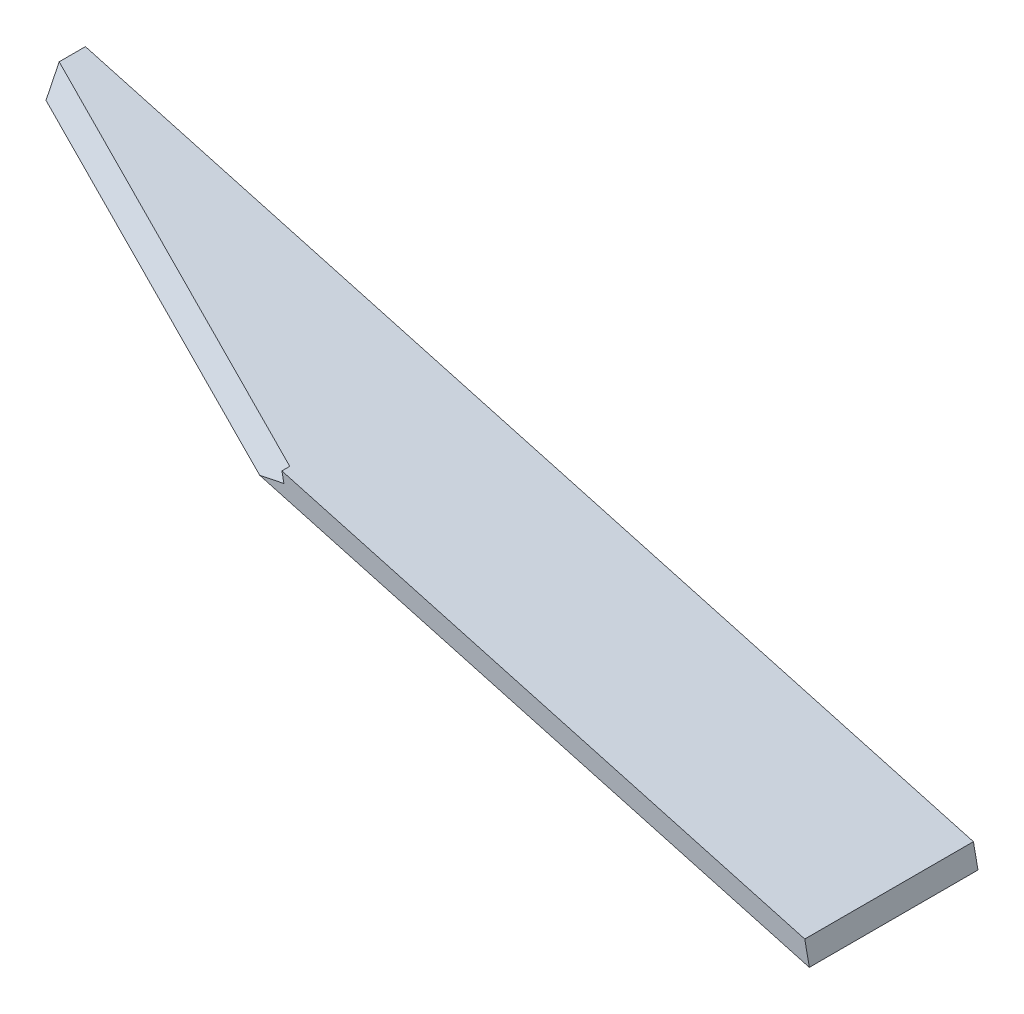
ISO-10303-21;
HEADER;
FILE_DESCRIPTION(('STEP AP214'),'2;1');
FILE_NAME('part.step','',(''),(''),'','','');
FILE_SCHEMA(('AUTOMOTIVE_DESIGN { 1 0 10303 214 1 1 1 1 }'));
ENDSEC;
DATA;
#1=APPLICATION_CONTEXT('core data for automotive mechanical design processes');
#2=APPLICATION_PROTOCOL_DEFINITION('international standard','automotive_design',2000,#1);
#3=PRODUCT_CONTEXT('',#1,'mechanical');
#4=PRODUCT('Part','Part','',(#3));
#5=PRODUCT_RELATED_PRODUCT_CATEGORY('part','',(#4));
#6=PRODUCT_DEFINITION_FORMATION('','',#4);
#7=PRODUCT_DEFINITION_CONTEXT('part definition',#1,'design');
#8=PRODUCT_DEFINITION('design','',#6,#7);
#9=PRODUCT_DEFINITION_SHAPE('','',#8);
#10=(LENGTH_UNIT() NAMED_UNIT(*) SI_UNIT(.MILLI.,.METRE.));
#11=(NAMED_UNIT(*) PLANE_ANGLE_UNIT() SI_UNIT($,.RADIAN.));
#12=(NAMED_UNIT(*) SI_UNIT($,.STERADIAN.) SOLID_ANGLE_UNIT());
#13=UNCERTAINTY_MEASURE_WITH_UNIT(LENGTH_MEASURE(1.E-05),#10,'distance_accuracy_value','');
#14=(GEOMETRIC_REPRESENTATION_CONTEXT(3) GLOBAL_UNCERTAINTY_ASSIGNED_CONTEXT((#13)) GLOBAL_UNIT_ASSIGNED_CONTEXT((#10,
#11,#12)) REPRESENTATION_CONTEXT('',''));
#15=CARTESIAN_POINT('',(0.,0.,0.));
#16=DIRECTION('',(0.,0.,1.));
#17=DIRECTION('',(1.,0.,0.));
#18=AXIS2_PLACEMENT_3D('',#15,#16,#17);
#19=CARTESIAN_POINT('',(-77.3810927083152,19.1832023042959,25.));
#20=DIRECTION('',(-0.265473079740289,-0.964118272792921,0.));
#21=DIRECTION('',(0.964118272792922,-0.265473079740289,0.));
#22=AXIS2_PLACEMENT_3D('',#19,#20,#21);
#23=PLANE('',#22);
#24=DIRECTION('',(0.,0.,-1.));
#25=VECTOR('',#24,1.);
#26=CARTESIAN_POINT('',(-154.885449628019,40.5242772588866,25.));
#27=LINE('',#26,#25);
#28=CARTESIAN_POINT('',(-154.885449628019,40.5242772588866,25.));
#29=VERTEX_POINT('',#28);
#30=CARTESIAN_POINT('',(-154.885449628019,40.5242772588866,23.8308301144486));
#31=VERTEX_POINT('',#30);
#32=EDGE_CURVE('E101',#29,#31,#27,.T.);
#33=ORIENTED_EDGE('',*,*,#32,.F.);
#34=DIRECTION('',(-0.964118272792921,0.265473079740289,0.));
#35=VECTOR('',#34,1.);
#36=CARTESIAN_POINT('',(-77.3810927083152,19.1832023042959,25.));
#37=LINE('',#36,#35);
#38=CARTESIAN_POINT('',(-77.3810927083152,19.1832023042959,25.));
#39=VERTEX_POINT('',#38);
#40=EDGE_CURVE('E86',#39,#29,#37,.T.);
#41=ORIENTED_EDGE('',*,*,#40,.F.);
#42=DIRECTION('',(0.,0.,-1.));
#43=VECTOR('',#42,1.);
#44=CARTESIAN_POINT('',(-77.3810927083152,19.1832023042959,25.));
#45=LINE('',#44,#43);
#46=CARTESIAN_POINT('',(-77.3810927083152,19.1832023042959,0.));
#47=VERTEX_POINT('',#46);
#48=EDGE_CURVE('E112',#39,#47,#45,.T.);
#49=ORIENTED_EDGE('',*,*,#48,.T.);
#50=DIRECTION('',(-0.964118272792921,0.265473079740289,0.));
#51=VECTOR('',#50,1.);
#52=CARTESIAN_POINT('',(-77.3810927083152,19.1832023042959,0.));
#53=LINE('',#52,#51);
#54=CARTESIAN_POINT('',(-209.008603900881,55.4272625621863,0.));
#55=VERTEX_POINT('',#54);
#56=EDGE_CURVE('E96',#47,#55,#53,.T.);
#57=ORIENTED_EDGE('',*,*,#56,.T.);
#58=DIRECTION('',(0.,0.,-1.));
#59=VECTOR('',#58,1.);
#60=CARTESIAN_POINT('',(-209.008603900881,55.4272625621863,25.));
#61=LINE('',#60,#59);
#62=CARTESIAN_POINT('',(-209.00860390124,55.4272625621122,3.89021068016565));
#63=VERTEX_POINT('',#62);
#64=EDGE_CURVE('E85',#63,#55,#61,.T.);
#65=ORIENTED_EDGE('',*,*,#64,.F.);
#66=DIRECTION('',(0.908505293732806,-0.250159866370883,0.334721036860205));
#67=VECTOR('',#66,1.);
#68=CARTESIAN_POINT('',(-85.7089995283556,21.4763183396365,49.3175424796902));
#69=LINE('',#68,#67);
#70=EDGE_CURVE('E105',#63,#31,#69,.T.);
#71=ORIENTED_EDGE('',*,*,#70,.T.);
#72=EDGE_LOOP('',(#33,#41,#49,#57,#65,#71));
#73=FACE_BOUND('',#72,.T.);
#74=ADVANCED_FACE('F33',(#73),#23,.F.);
#75=CARTESIAN_POINT('',(0.,0.,25.));
#76=DIRECTION('',(0.,0.,-1.));
#77=DIRECTION('',(-1.,0.,0.));
#78=AXIS2_PLACEMENT_3D('',#75,#76,#77);
#79=PLANE('',#78);
#80=DIRECTION('',(-0.201886068959674,0.979409013211544,0.));
#81=VECTOR('',#80,1.);
#82=CARTESIAN_POINT('',(-140.55980456013,-28.973662702301,25.));
#83=LINE('',#82,#81);
#84=CARTESIAN_POINT('',(-154.583333341565,39.0586218250288,25.));
#85=VERTEX_POINT('',#84);
#86=EDGE_CURVE('E11',#85,#29,#83,.T.);
#87=ORIENTED_EDGE('',*,*,#86,.F.);
#88=DIRECTION('',(-0.979409013211543,-0.201886068959675,0.));
#89=VECTOR('',#88,1.);
#90=CARTESIAN_POINT('',(-14.0235287814348,68.0322845273299,25.));
#91=LINE('',#90,#89);
#92=CARTESIAN_POINT('',(-158.174700165382,38.3183315882919,25.));
#93=VERTEX_POINT('',#92);
#94=EDGE_CURVE('E41',#85,#93,#91,.T.);
#95=ORIENTED_EDGE('',*,*,#94,.T.);
#96=DIRECTION('',(0.964118272792922,-0.265473079740289,0.));
#97=VECTOR('',#96,1.);
#98=CARTESIAN_POINT('',(-76.7010903996199,15.8843100450442,25.));
#99=LINE('',#98,#97);
#100=CARTESIAN_POINT('',(-76.7010903996199,15.8843100450442,25.));
#101=VERTEX_POINT('',#100);
#102=EDGE_CURVE('E95',#93,#101,#99,.T.);
#103=ORIENTED_EDGE('',*,*,#102,.T.);
#104=DIRECTION('',(-0.201886068959398,0.9794090132116,0.));
#105=VECTOR('',#104,1.);
#106=CARTESIAN_POINT('',(-76.7010903996199,15.8843100450442,25.));
#107=LINE('',#106,#105);
#108=EDGE_CURVE('E57',#101,#39,#107,.T.);
#109=ORIENTED_EDGE('',*,*,#108,.T.);
#110=ORIENTED_EDGE('',*,*,#40,.T.);
#111=EDGE_LOOP('',(#87,#95,#103,#109,#110));
#112=FACE_BOUND('',#111,.T.);
#113=ADVANCED_FACE('F117',(#112),#79,.F.);
#114=CARTESIAN_POINT('',(-76.7010903996199,15.8843100450442,25.));
#115=DIRECTION('',(0.265473079740289,0.964118272792922,0.));
#116=DIRECTION('',(-0.964118272792922,0.265473079740289,0.));
#117=AXIS2_PLACEMENT_3D('',#114,#115,#116);
#118=PLANE('',#117);
#119=ORIENTED_EDGE('',*,*,#102,.F.);
#120=DIRECTION('',(-0.908505293732806,0.250159866370883,-0.334721036860204));
#121=VECTOR('',#120,1.);
#122=CARTESIAN_POINT('',(-85.8292447461203,18.3977768209515,51.6542705002451));
#123=LINE('',#122,#121);
#124=CARTESIAN_POINT('',(-208.328601592544,52.1283703028601,6.52177427696833));
#125=VERTEX_POINT('',#124);
#126=EDGE_CURVE('E48',#93,#125,#123,.T.);
#127=ORIENTED_EDGE('',*,*,#126,.T.);
#128=DIRECTION('',(0.,0.,-1.));
#129=VECTOR('',#128,1.);
#130=CARTESIAN_POINT('',(-208.328601592185,52.1283703029341,25.));
#131=LINE('',#130,#129);
#132=CARTESIAN_POINT('',(-208.328601592185,52.1283703029341,0.));
#133=VERTEX_POINT('',#132);
#134=EDGE_CURVE('E76',#125,#133,#131,.T.);
#135=ORIENTED_EDGE('',*,*,#134,.T.);
#136=DIRECTION('',(0.964118272792922,-0.265473079740289,0.));
#137=VECTOR('',#136,1.);
#138=CARTESIAN_POINT('',(-76.7010903996199,15.8843100450442,0.));
#139=LINE('',#138,#137);
#140=CARTESIAN_POINT('',(-76.7010903996199,15.8843100450442,0.));
#141=VERTEX_POINT('',#140);
#142=EDGE_CURVE('E81',#133,#141,#139,.T.);
#143=ORIENTED_EDGE('',*,*,#142,.T.);
#144=DIRECTION('',(0.,0.,-1.));
#145=VECTOR('',#144,1.);
#146=CARTESIAN_POINT('',(-76.7010903996199,15.8843100450442,25.));
#147=LINE('',#146,#145);
#148=EDGE_CURVE('E115',#101,#141,#147,.T.);
#149=ORIENTED_EDGE('',*,*,#148,.F.);
#150=EDGE_LOOP('',(#119,#127,#135,#143,#149));
#151=FACE_BOUND('',#150,.T.);
#152=ADVANCED_FACE('F35',(#151),#118,.F.);
#153=CARTESIAN_POINT('',(-76.7010903996199,15.8843100450442,25.));
#154=DIRECTION('',(-0.979409013211601,-0.201886068959398,0.));
#155=DIRECTION('',(0.201886068959398,-0.979409013211601,0.));
#156=AXIS2_PLACEMENT_3D('',#153,#154,#155);
#157=PLANE('',#156);
#158=DIRECTION('',(-0.201886068959398,0.9794090132116,0.));
#159=VECTOR('',#158,1.);
#160=CARTESIAN_POINT('',(-76.7010903996199,15.8843100450442,0.));
#161=LINE('',#160,#159);
#162=EDGE_CURVE('E99',#141,#47,#161,.T.);
#163=ORIENTED_EDGE('',*,*,#162,.T.);
#164=ORIENTED_EDGE('',*,*,#48,.F.);
#165=ORIENTED_EDGE('',*,*,#108,.F.);
#166=ORIENTED_EDGE('',*,*,#148,.T.);
#167=EDGE_LOOP('',(#163,#164,#165,#166));
#168=FACE_BOUND('',#167,.T.);
#169=ADVANCED_FACE('F139',(#168),#157,.F.);
#170=CARTESIAN_POINT('',(-208.328601592185,52.1283703029341,25.));
#171=DIRECTION('',(0.979409013211552,0.201886068959632,0.));
#172=DIRECTION('',(-0.201886068959632,0.979409013211552,0.));
#173=AXIS2_PLACEMENT_3D('',#170,#171,#172);
#174=PLANE('',#173);
#175=ORIENTED_EDGE('',*,*,#134,.F.);
#176=DIRECTION('',(0.159088393343612,-0.771784834590043,0.615661475325659));
#177=VECTOR('',#176,1.);
#178=CARTESIAN_POINT('',(-203.031911674634,26.4325614116406,27.0196111126165));
#179=LINE('',#178,#177);
#180=EDGE_CURVE('E128',#63,#125,#179,.T.);
#181=ORIENTED_EDGE('',*,*,#180,.F.);
#182=ORIENTED_EDGE('',*,*,#64,.T.);
#183=DIRECTION('',(0.201886068959632,-0.979409013211552,0.));
#184=VECTOR('',#183,1.);
#185=CARTESIAN_POINT('',(-208.328601592185,52.1283703029341,0.));
#186=LINE('',#185,#184);
#187=EDGE_CURVE('E89',#55,#133,#186,.T.);
#188=ORIENTED_EDGE('',*,*,#187,.T.);
#189=EDGE_LOOP('',(#175,#181,#182,#188));
#190=FACE_BOUND('',#189,.T.);
#191=ADVANCED_FACE('F90',(#190),#174,.F.);
#192=CARTESIAN_POINT('',(0.,0.,0.));
#193=DIRECTION('',(0.,0.,-1.));
#194=DIRECTION('',(-1.,0.,0.));
#195=AXIS2_PLACEMENT_3D('',#192,#193,#194);
#196=PLANE('',#195);
#197=ORIENTED_EDGE('',*,*,#142,.F.);
#198=ORIENTED_EDGE('',*,*,#187,.F.);
#199=ORIENTED_EDGE('',*,*,#56,.F.);
#200=ORIENTED_EDGE('',*,*,#162,.F.);
#201=EDGE_LOOP('',(#197,#198,#199,#200));
#202=FACE_BOUND('',#201,.T.);
#203=ADVANCED_FACE('F98',(#202),#196,.T.);
#204=CARTESIAN_POINT('',(-156.129050778534,46.5573541419581,40.1279658965156));
#205=DIRECTION('',(-0.979409013211544,-0.201886068959674,0.));
#206=DIRECTION('',(0.201886068959674,-0.979409013211544,0.));
#207=AXIS2_PLACEMENT_3D('',#204,#205,#206);
#208=PLANE('',#207);
#209=ORIENTED_EDGE('',*,*,#32,.T.);
#210=DIRECTION('',(-0.159088393343611,0.771784834590043,-0.615661475325659));
#211=VECTOR('',#210,1.);
#212=CARTESIAN_POINT('',(-154.061461014057,36.5268648596243,27.0196111126165));
#213=LINE('',#212,#211);
#214=EDGE_CURVE('E126',#85,#31,#213,.T.);
#215=ORIENTED_EDGE('',*,*,#214,.F.);
#216=ORIENTED_EDGE('',*,*,#86,.T.);
#217=EDGE_LOOP('',(#209,#215,#216));
#218=FACE_BOUND('',#217,.T.);
#219=ADVANCED_FACE('F154',(#218),#208,.T.);
#220=CARTESIAN_POINT('',(-7.76407993164473,37.6658473936931,49.2236497119166));
#221=DIRECTION('',(0.124293475063411,-0.602984398021067,-0.788010753606721));
#222=DIRECTION('',(0.,0.79416913827495,-0.607696782788607));
#223=AXIS2_PLACEMENT_3D('',#220,#221,#222);
#224=PLANE('',#223);
#225=ORIENTED_EDGE('',*,*,#180,.T.);
#226=ORIENTED_EDGE('',*,*,#126,.F.);
#227=ORIENTED_EDGE('',*,*,#94,.F.);
#228=ORIENTED_EDGE('',*,*,#214,.T.);
#229=ORIENTED_EDGE('',*,*,#70,.F.);
#230=EDGE_LOOP('',(#225,#226,#227,#228,#229));
#231=FACE_BOUND('',#230,.T.);
#232=ADVANCED_FACE('F130',(#231),#224,.F.);
#233=CLOSED_SHELL('',(#74,#113,#152,#169,#191,#203,#219,#232));
#234=MANIFOLD_SOLID_BREP('B2',#233);
#235=ADVANCED_BREP_SHAPE_REPRESENTATION('',(#18,#234),#14);
#236=SHAPE_DEFINITION_REPRESENTATION(#9,#235);
ENDSEC;
END-ISO-10303-21;
